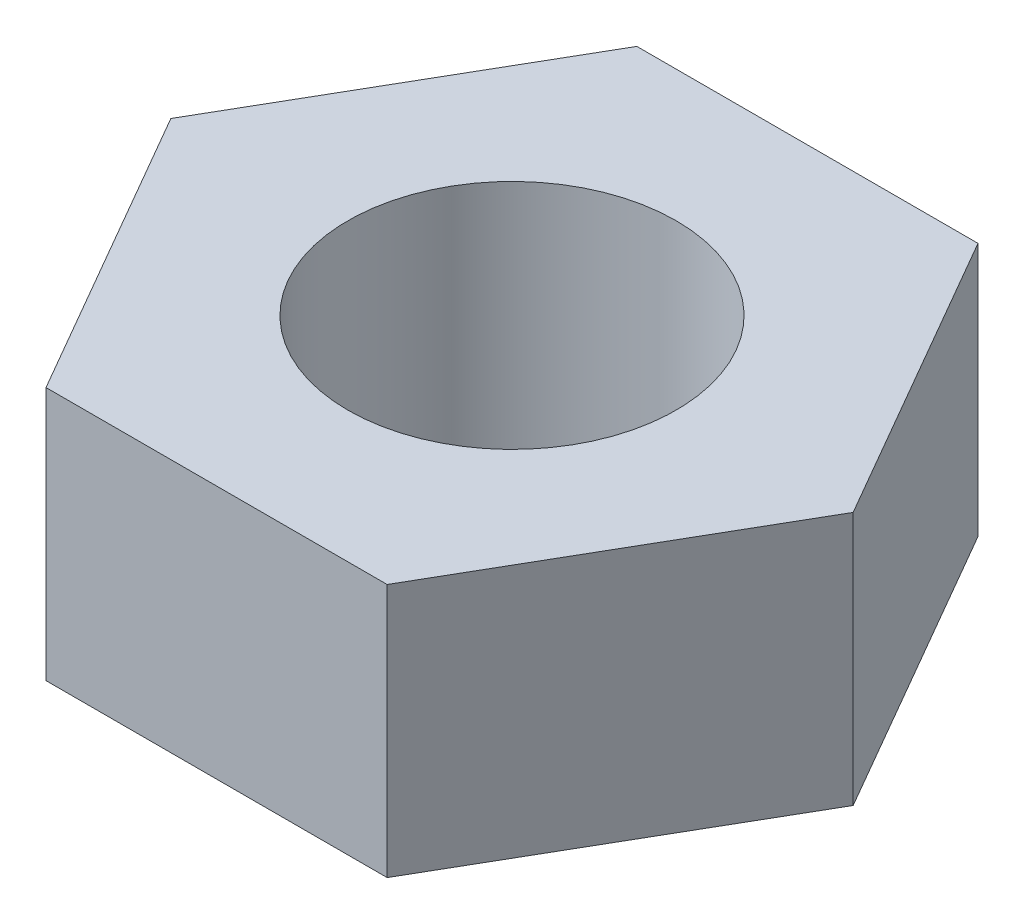
ISO-10303-21;
HEADER;
FILE_DESCRIPTION(('STEP AP214'),'2;1');
FILE_NAME('part.step','',(''),(''),'','','');
FILE_SCHEMA(('AUTOMOTIVE_DESIGN { 1 0 10303 214 1 1 1 1 }'));
ENDSEC;
DATA;
#1=APPLICATION_CONTEXT('core data for automotive mechanical design processes');
#2=APPLICATION_PROTOCOL_DEFINITION('international standard','automotive_design',2000,#1);
#3=PRODUCT_CONTEXT('',#1,'mechanical');
#4=PRODUCT('Part','Part','',(#3));
#5=PRODUCT_RELATED_PRODUCT_CATEGORY('part','',(#4));
#6=PRODUCT_DEFINITION_FORMATION('','',#4);
#7=PRODUCT_DEFINITION_CONTEXT('part definition',#1,'design');
#8=PRODUCT_DEFINITION('design','',#6,#7);
#9=PRODUCT_DEFINITION_SHAPE('','',#8);
#10=(LENGTH_UNIT() NAMED_UNIT(*) SI_UNIT(.MILLI.,.METRE.));
#11=(NAMED_UNIT(*) PLANE_ANGLE_UNIT() SI_UNIT($,.RADIAN.));
#12=(NAMED_UNIT(*) SI_UNIT($,.STERADIAN.) SOLID_ANGLE_UNIT());
#13=UNCERTAINTY_MEASURE_WITH_UNIT(LENGTH_MEASURE(1.E-05),#10,'distance_accuracy_value','');
#14=(GEOMETRIC_REPRESENTATION_CONTEXT(3) GLOBAL_UNCERTAINTY_ASSIGNED_CONTEXT((#13)) GLOBAL_UNIT_ASSIGNED_CONTEXT((#10,
#11,#12)) REPRESENTATION_CONTEXT('',''));
#15=CARTESIAN_POINT('',(0.,0.,0.));
#16=DIRECTION('',(0.,0.,1.));
#17=DIRECTION('',(1.,0.,0.));
#18=AXIS2_PLACEMENT_3D('',#15,#16,#17);
#19=CARTESIAN_POINT('',(0.,2.32,0.));
#20=DIRECTION('',(0.,1.,0.));
#21=DIRECTION('',(0.,0.,1.));
#22=AXIS2_PLACEMENT_3D('',#19,#20,#21);
#23=PLANE('',#22);
#24=DIRECTION('',(-1.,0.,0.));
#25=VECTOR('',#24,1.);
#26=CARTESIAN_POINT('',(1.55884572681199,2.32,-2.7));
#27=LINE('',#26,#25);
#28=CARTESIAN_POINT('',(1.55884572681199,2.32,-2.7));
#29=VERTEX_POINT('',#28);
#30=CARTESIAN_POINT('',(-1.55884572681199,2.32,-2.7));
#31=VERTEX_POINT('',#30);
#32=EDGE_CURVE('E130',#29,#31,#27,.T.);
#33=ORIENTED_EDGE('',*,*,#32,.T.);
#34=DIRECTION('',(-0.5,0.,0.866025403784439));
#35=VECTOR('',#34,1.);
#36=CARTESIAN_POINT('',(-1.55884572681199,2.32,-2.7));
#37=LINE('',#36,#35);
#38=CARTESIAN_POINT('',(-3.11769145362398,2.32,0.));
#39=VERTEX_POINT('',#38);
#40=EDGE_CURVE('E88',#31,#39,#37,.T.);
#41=ORIENTED_EDGE('',*,*,#40,.T.);
#42=DIRECTION('',(0.5,0.,0.866025403784439));
#43=VECTOR('',#42,1.);
#44=CARTESIAN_POINT('',(-3.11769145362398,2.32,0.));
#45=LINE('',#44,#43);
#46=CARTESIAN_POINT('',(-1.55884572681199,2.32,2.7));
#47=VERTEX_POINT('',#46);
#48=EDGE_CURVE('E101',#39,#47,#45,.T.);
#49=ORIENTED_EDGE('',*,*,#48,.T.);
#50=DIRECTION('',(1.,0.,0.));
#51=VECTOR('',#50,1.);
#52=CARTESIAN_POINT('',(-1.55884572681199,2.32,2.7));
#53=LINE('',#52,#51);
#54=CARTESIAN_POINT('',(1.55884572681199,2.32,2.7));
#55=VERTEX_POINT('',#54);
#56=EDGE_CURVE('E95',#47,#55,#53,.T.);
#57=ORIENTED_EDGE('',*,*,#56,.T.);
#58=DIRECTION('',(0.5,0.,-0.866025403784439));
#59=VECTOR('',#58,1.);
#60=CARTESIAN_POINT('',(1.55884572681199,2.32,2.7));
#61=LINE('',#60,#59);
#62=CARTESIAN_POINT('',(3.11769145362398,2.32,0.));
#63=VERTEX_POINT('',#62);
#64=EDGE_CURVE('E99',#55,#63,#61,.T.);
#65=ORIENTED_EDGE('',*,*,#64,.T.);
#66=DIRECTION('',(-0.5,0.,-0.866025403784439));
#67=VECTOR('',#66,1.);
#68=CARTESIAN_POINT('',(3.11769145362398,2.32,0.));
#69=LINE('',#68,#67);
#70=EDGE_CURVE('E51',#63,#29,#69,.T.);
#71=ORIENTED_EDGE('',*,*,#70,.T.);
#72=EDGE_LOOP('',(#33,#41,#49,#57,#65,#71));
#73=FACE_BOUND('',#72,.T.);
#74=CARTESIAN_POINT('',(0.,2.32,0.));
#75=DIRECTION('',(0.,1.,0.));
#76=DIRECTION('',(0.,0.,1.));
#77=AXIS2_PLACEMENT_3D('',#74,#75,#76);
#78=CIRCLE('',#77,1.5);
#79=CARTESIAN_POINT('',(0.,2.32,1.5));
#80=VERTEX_POINT('',#79);
#81=EDGE_CURVE('E123',#80,#80,#78,.T.);
#82=ORIENTED_EDGE('',*,*,#81,.F.);
#83=EDGE_LOOP('',(#82));
#84=FACE_BOUND('',#83,.T.);
#85=ADVANCED_FACE('F34',(#73,#84),#23,.T.);
#86=CARTESIAN_POINT('',(0.,0.,0.));
#87=DIRECTION('',(0.,1.,0.));
#88=DIRECTION('',(0.,0.,1.));
#89=AXIS2_PLACEMENT_3D('',#86,#87,#88);
#90=PLANE('',#89);
#91=DIRECTION('',(-1.,0.,0.));
#92=VECTOR('',#91,1.);
#93=CARTESIAN_POINT('',(1.55884572681199,0.,-2.7));
#94=LINE('',#93,#92);
#95=CARTESIAN_POINT('',(1.55884572681199,0.,-2.7));
#96=VERTEX_POINT('',#95);
#97=CARTESIAN_POINT('',(-1.55884572681199,0.,-2.7));
#98=VERTEX_POINT('',#97);
#99=EDGE_CURVE('E119',#96,#98,#94,.T.);
#100=ORIENTED_EDGE('',*,*,#99,.F.);
#101=DIRECTION('',(-0.5,0.,-0.866025403784439));
#102=VECTOR('',#101,1.);
#103=CARTESIAN_POINT('',(3.11769145362398,0.,0.));
#104=LINE('',#103,#102);
#105=CARTESIAN_POINT('',(3.11769145362398,0.,0.));
#106=VERTEX_POINT('',#105);
#107=EDGE_CURVE('E80',#106,#96,#104,.T.);
#108=ORIENTED_EDGE('',*,*,#107,.F.);
#109=DIRECTION('',(0.5,0.,-0.866025403784439));
#110=VECTOR('',#109,1.);
#111=CARTESIAN_POINT('',(1.55884572681199,0.,2.7));
#112=LINE('',#111,#110);
#113=CARTESIAN_POINT('',(1.55884572681199,0.,2.7));
#114=VERTEX_POINT('',#113);
#115=EDGE_CURVE('E74',#114,#106,#112,.T.);
#116=ORIENTED_EDGE('',*,*,#115,.F.);
#117=DIRECTION('',(1.,0.,0.));
#118=VECTOR('',#117,1.);
#119=CARTESIAN_POINT('',(-1.55884572681199,0.,2.7));
#120=LINE('',#119,#118);
#121=CARTESIAN_POINT('',(-1.55884572681199,0.,2.7));
#122=VERTEX_POINT('',#121);
#123=EDGE_CURVE('E109',#122,#114,#120,.T.);
#124=ORIENTED_EDGE('',*,*,#123,.F.);
#125=DIRECTION('',(0.5,0.,0.866025403784439));
#126=VECTOR('',#125,1.);
#127=CARTESIAN_POINT('',(-3.11769145362398,0.,0.));
#128=LINE('',#127,#126);
#129=CARTESIAN_POINT('',(-3.11769145362398,0.,0.));
#130=VERTEX_POINT('',#129);
#131=EDGE_CURVE('E125',#130,#122,#128,.T.);
#132=ORIENTED_EDGE('',*,*,#131,.F.);
#133=DIRECTION('',(-0.5,0.,0.866025403784439));
#134=VECTOR('',#133,1.);
#135=CARTESIAN_POINT('',(-1.55884572681199,0.,-2.7));
#136=LINE('',#135,#134);
#137=EDGE_CURVE('E122',#98,#130,#136,.T.);
#138=ORIENTED_EDGE('',*,*,#137,.F.);
#139=EDGE_LOOP('',(#100,#108,#116,#124,#132,#138));
#140=FACE_BOUND('',#139,.T.);
#141=CARTESIAN_POINT('',(0.,0.,0.));
#142=DIRECTION('',(0.,1.,0.));
#143=DIRECTION('',(0.,0.,1.));
#144=AXIS2_PLACEMENT_3D('',#141,#142,#143);
#145=CIRCLE('',#144,1.5);
#146=CARTESIAN_POINT('',(0.,0.,1.5));
#147=VERTEX_POINT('',#146);
#148=EDGE_CURVE('E223',#147,#147,#145,.T.);
#149=ORIENTED_EDGE('',*,*,#148,.T.);
#150=EDGE_LOOP('',(#149));
#151=FACE_BOUND('',#150,.T.);
#152=ADVANCED_FACE('F139',(#140,#151),#90,.F.);
#153=CARTESIAN_POINT('',(1.55884572681199,2.32,-2.7));
#154=DIRECTION('',(0.,0.,1.));
#155=DIRECTION('',(1.,0.,0.));
#156=AXIS2_PLACEMENT_3D('',#153,#154,#155);
#157=PLANE('',#156);
#158=ORIENTED_EDGE('',*,*,#99,.T.);
#159=DIRECTION('',(0.,-1.,0.));
#160=VECTOR('',#159,1.);
#161=CARTESIAN_POINT('',(-1.55884572681199,2.32,-2.7));
#162=LINE('',#161,#160);
#163=EDGE_CURVE('E11',#31,#98,#162,.T.);
#164=ORIENTED_EDGE('',*,*,#163,.F.);
#165=ORIENTED_EDGE('',*,*,#32,.F.);
#166=DIRECTION('',(0.,-1.,0.));
#167=VECTOR('',#166,1.);
#168=CARTESIAN_POINT('',(1.55884572681199,2.32,-2.7));
#169=LINE('',#168,#167);
#170=EDGE_CURVE('E115',#29,#96,#169,.T.);
#171=ORIENTED_EDGE('',*,*,#170,.T.);
#172=EDGE_LOOP('',(#158,#164,#165,#171));
#173=FACE_BOUND('',#172,.T.);
#174=ADVANCED_FACE('F36',(#173),#157,.F.);
#175=CARTESIAN_POINT('',(-1.55884572681199,2.32,-2.7));
#176=DIRECTION('',(0.866025403784439,0.,0.5));
#177=DIRECTION('',(0.5,0.,-0.866025403784439));
#178=AXIS2_PLACEMENT_3D('',#175,#176,#177);
#179=PLANE('',#178);
#180=ORIENTED_EDGE('',*,*,#137,.T.);
#181=DIRECTION('',(0.,-1.,0.));
#182=VECTOR('',#181,1.);
#183=CARTESIAN_POINT('',(-3.11769145362398,2.32,0.));
#184=LINE('',#183,#182);
#185=EDGE_CURVE('E43',#39,#130,#184,.T.);
#186=ORIENTED_EDGE('',*,*,#185,.F.);
#187=ORIENTED_EDGE('',*,*,#40,.F.);
#188=ORIENTED_EDGE('',*,*,#163,.T.);
#189=EDGE_LOOP('',(#180,#186,#187,#188));
#190=FACE_BOUND('',#189,.T.);
#191=ADVANCED_FACE('F164',(#190),#179,.F.);
#192=CARTESIAN_POINT('',(-3.11769145362398,2.32,0.));
#193=DIRECTION('',(0.866025403784439,0.,-0.5));
#194=DIRECTION('',(-0.5,0.,-0.866025403784439));
#195=AXIS2_PLACEMENT_3D('',#192,#193,#194);
#196=PLANE('',#195);
#197=ORIENTED_EDGE('',*,*,#131,.T.);
#198=DIRECTION('',(0.,-1.,0.));
#199=VECTOR('',#198,1.);
#200=CARTESIAN_POINT('',(-1.55884572681199,2.32,2.7));
#201=LINE('',#200,#199);
#202=EDGE_CURVE('E110',#47,#122,#201,.T.);
#203=ORIENTED_EDGE('',*,*,#202,.F.);
#204=ORIENTED_EDGE('',*,*,#48,.F.);
#205=ORIENTED_EDGE('',*,*,#185,.T.);
#206=EDGE_LOOP('',(#197,#203,#204,#205));
#207=FACE_BOUND('',#206,.T.);
#208=ADVANCED_FACE('F136',(#207),#196,.F.);
#209=CARTESIAN_POINT('',(-1.55884572681199,2.32,2.7));
#210=DIRECTION('',(0.,0.,-1.));
#211=DIRECTION('',(-1.,0.,0.));
#212=AXIS2_PLACEMENT_3D('',#209,#210,#211);
#213=PLANE('',#212);
#214=ORIENTED_EDGE('',*,*,#123,.T.);
#215=DIRECTION('',(0.,-1.,0.));
#216=VECTOR('',#215,1.);
#217=CARTESIAN_POINT('',(1.55884572681199,2.32,2.7));
#218=LINE('',#217,#216);
#219=EDGE_CURVE('E106',#55,#114,#218,.T.);
#220=ORIENTED_EDGE('',*,*,#219,.F.);
#221=ORIENTED_EDGE('',*,*,#56,.F.);
#222=ORIENTED_EDGE('',*,*,#202,.T.);
#223=EDGE_LOOP('',(#214,#220,#221,#222));
#224=FACE_BOUND('',#223,.T.);
#225=ADVANCED_FACE('F107',(#224),#213,.F.);
#226=CARTESIAN_POINT('',(1.55884572681199,2.32,2.7));
#227=DIRECTION('',(-0.866025403784439,0.,-0.5));
#228=DIRECTION('',(-0.5,0.,0.866025403784439));
#229=AXIS2_PLACEMENT_3D('',#226,#227,#228);
#230=PLANE('',#229);
#231=ORIENTED_EDGE('',*,*,#115,.T.);
#232=DIRECTION('',(0.,-1.,0.));
#233=VECTOR('',#232,1.);
#234=CARTESIAN_POINT('',(3.11769145362398,2.32,0.));
#235=LINE('',#234,#233);
#236=EDGE_CURVE('E111',#63,#106,#235,.T.);
#237=ORIENTED_EDGE('',*,*,#236,.F.);
#238=ORIENTED_EDGE('',*,*,#64,.F.);
#239=ORIENTED_EDGE('',*,*,#219,.T.);
#240=EDGE_LOOP('',(#231,#237,#238,#239));
#241=FACE_BOUND('',#240,.T.);
#242=ADVANCED_FACE('F113',(#241),#230,.F.);
#243=CARTESIAN_POINT('',(3.11769145362398,2.32,0.));
#244=DIRECTION('',(-0.866025403784439,0.,0.5));
#245=DIRECTION('',(0.5,0.,0.866025403784439));
#246=AXIS2_PLACEMENT_3D('',#243,#244,#245);
#247=PLANE('',#246);
#248=ORIENTED_EDGE('',*,*,#107,.T.);
#249=ORIENTED_EDGE('',*,*,#170,.F.);
#250=ORIENTED_EDGE('',*,*,#70,.F.);
#251=ORIENTED_EDGE('',*,*,#236,.T.);
#252=EDGE_LOOP('',(#248,#249,#250,#251));
#253=FACE_BOUND('',#252,.T.);
#254=ADVANCED_FACE('F144',(#253),#247,.F.);
#255=CARTESIAN_POINT('',(0.,2.32,0.));
#256=DIRECTION('',(0.,-1.,0.));
#257=DIRECTION('',(0.,0.,-1.));
#258=AXIS2_PLACEMENT_3D('',#255,#256,#257);
#259=CYLINDRICAL_SURFACE('',#258,1.5);
#260=ORIENTED_EDGE('',*,*,#81,.T.);
#261=EDGE_LOOP('',(#260));
#262=FACE_BOUND('',#261,.T.);
#263=ORIENTED_EDGE('',*,*,#148,.F.);
#264=EDGE_LOOP('',(#263));
#265=FACE_BOUND('',#264,.T.);
#266=ADVANCED_FACE('F146',(#262,#265),#259,.F.);
#267=CLOSED_SHELL('',(#85,#152,#174,#191,#208,#225,#242,#254,#266));
#268=MANIFOLD_SOLID_BREP('B2',#267);
#269=ADVANCED_BREP_SHAPE_REPRESENTATION('',(#18,#268),#14);
#270=SHAPE_DEFINITION_REPRESENTATION(#9,#269);
ENDSEC;
END-ISO-10303-21;
